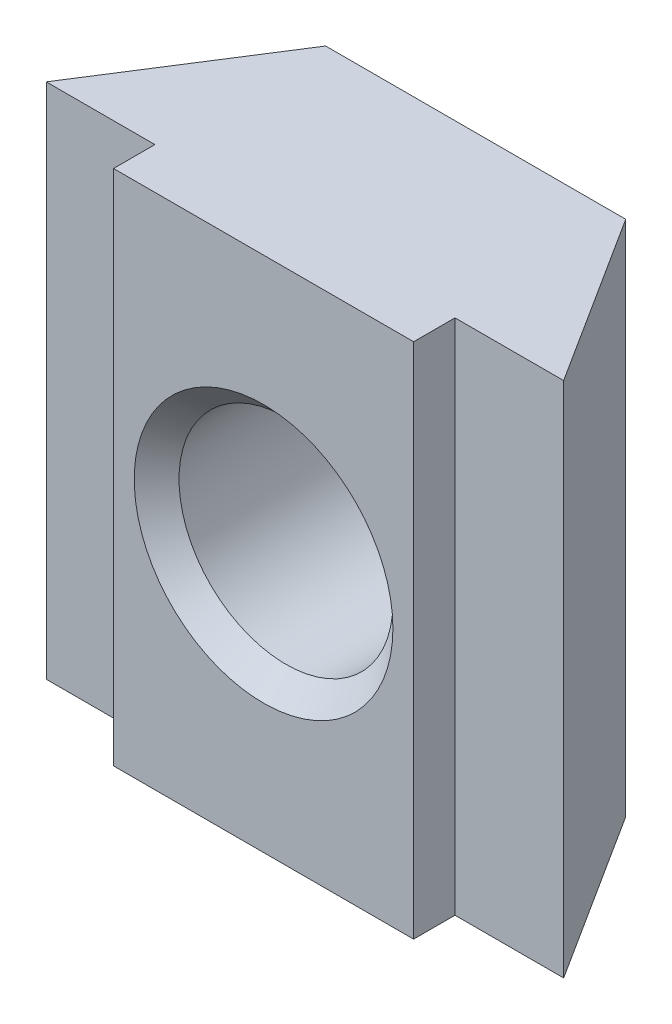
ISO-10303-21;
HEADER;
FILE_DESCRIPTION(('STEP AP214'),'2;1');
FILE_NAME('part.step','',(''),(''),'','','');
FILE_SCHEMA(('AUTOMOTIVE_DESIGN { 1 0 10303 214 1 1 1 1 }'));
ENDSEC;
DATA;
#1=APPLICATION_CONTEXT('core data for automotive mechanical design processes');
#2=APPLICATION_PROTOCOL_DEFINITION('international standard','automotive_design',2000,#1);
#3=PRODUCT_CONTEXT('',#1,'mechanical');
#4=PRODUCT('Part','Part','',(#3));
#5=PRODUCT_RELATED_PRODUCT_CATEGORY('part','',(#4));
#6=PRODUCT_DEFINITION_FORMATION('','',#4);
#7=PRODUCT_DEFINITION_CONTEXT('part definition',#1,'design');
#8=PRODUCT_DEFINITION('design','',#6,#7);
#9=PRODUCT_DEFINITION_SHAPE('','',#8);
#10=(LENGTH_UNIT() NAMED_UNIT(*) SI_UNIT(.MILLI.,.METRE.));
#11=(NAMED_UNIT(*) PLANE_ANGLE_UNIT() SI_UNIT($,.RADIAN.));
#12=(NAMED_UNIT(*) SI_UNIT($,.STERADIAN.) SOLID_ANGLE_UNIT());
#13=UNCERTAINTY_MEASURE_WITH_UNIT(LENGTH_MEASURE(1.E-05),#10,'distance_accuracy_value','');
#14=(GEOMETRIC_REPRESENTATION_CONTEXT(3) GLOBAL_UNCERTAINTY_ASSIGNED_CONTEXT((#13)) GLOBAL_UNIT_ASSIGNED_CONTEXT((#10,
#11,#12)) REPRESENTATION_CONTEXT('',''));
#15=CARTESIAN_POINT('',(0.,0.,0.));
#16=DIRECTION('',(0.,0.,1.));
#17=DIRECTION('',(1.,0.,0.));
#18=AXIS2_PLACEMENT_3D('',#15,#16,#17);
#19=CARTESIAN_POINT('',(-13.,21.5,-9.30000000010978));
#20=DIRECTION('',(0.,0.,1.));
#21=DIRECTION('',(1.,0.,0.));
#22=AXIS2_PLACEMENT_3D('',#19,#20,#21);
#23=CONICAL_SURFACE('',#22,2.49999999991769,0.785398163397448);
#24=CARTESIAN_POINT('',(-13.,21.5,-9.30000000005293));
#25=DIRECTION('',(0.,0.,1.));
#26=DIRECTION('',(1.,0.,0.));
#27=AXIS2_PLACEMENT_3D('',#24,#25,#26);
#28=CIRCLE('',#27,2.49999999997453);
#29=CARTESIAN_POINT('',(-10.5000000000255,21.5,-9.30000000005293));
#30=VERTEX_POINT('',#29);
#31=EDGE_CURVE('E20',#30,#30,#28,.F.);
#32=ORIENTED_EDGE('',*,*,#31,.F.);
#33=EDGE_LOOP('',(#32));
#34=FACE_BOUND('',#33,.T.);
#35=CARTESIAN_POINT('',(-13.,21.5,-9.733));
#36=DIRECTION('',(0.,0.,1.));
#37=DIRECTION('',(1.,0.,0.));
#38=AXIS2_PLACEMENT_3D('',#35,#36,#37);
#39=CIRCLE('',#38,2.067);
#40=CARTESIAN_POINT('',(-10.933,21.5,-9.733));
#41=VERTEX_POINT('',#40);
#42=EDGE_CURVE('E122',#41,#41,#39,.F.);
#43=ORIENTED_EDGE('',*,*,#42,.T.);
#44=EDGE_LOOP('',(#43));
#45=FACE_BOUND('',#44,.T.);
#46=ADVANCED_FACE('F17',(#34,#45),#23,.F.);
#47=CARTESIAN_POINT('',(-15.9,16.5,-9.3));
#48=DIRECTION('',(-1.,0.,0.));
#49=DIRECTION('',(0.,0.,1.));
#50=AXIS2_PLACEMENT_3D('',#47,#48,#49);
#51=PLANE('',#50);
#52=DIRECTION('',(0.,0.,1.));
#53=VECTOR('',#52,1.);
#54=CARTESIAN_POINT('',(-15.9,16.5,-9.3));
#55=LINE('',#54,#53);
#56=CARTESIAN_POINT('',(-15.9,16.5,-10.1));
#57=VERTEX_POINT('',#56);
#58=CARTESIAN_POINT('',(-15.9,16.5,-9.3));
#59=VERTEX_POINT('',#58);
#60=EDGE_CURVE('E125',#57,#59,#55,.T.);
#61=ORIENTED_EDGE('',*,*,#60,.T.);
#62=DIRECTION('',(0.,1.,0.));
#63=VECTOR('',#62,1.);
#64=CARTESIAN_POINT('',(-15.9,16.5,-9.3));
#65=LINE('',#64,#63);
#66=CARTESIAN_POINT('',(-15.9,26.5,-9.3));
#67=VERTEX_POINT('',#66);
#68=EDGE_CURVE('E104',#67,#59,#65,.F.);
#69=ORIENTED_EDGE('',*,*,#68,.F.);
#70=DIRECTION('',(0.,0.,1.));
#71=VECTOR('',#70,1.);
#72=CARTESIAN_POINT('',(-15.9,26.5,-9.3));
#73=LINE('',#72,#71);
#74=CARTESIAN_POINT('',(-15.9,26.5,-10.1));
#75=VERTEX_POINT('',#74);
#76=EDGE_CURVE('E79',#67,#75,#73,.F.);
#77=ORIENTED_EDGE('',*,*,#76,.T.);
#78=DIRECTION('',(0.,1.,0.));
#79=VECTOR('',#78,1.);
#80=CARTESIAN_POINT('',(-15.9,16.5,-10.1));
#81=LINE('',#80,#79);
#82=EDGE_CURVE('E103',#57,#75,#81,.T.);
#83=ORIENTED_EDGE('',*,*,#82,.F.);
#84=EDGE_LOOP('',(#61,#69,#77,#83));
#85=FACE_BOUND('',#84,.T.);
#86=ADVANCED_FACE('F263',(#85),#51,.T.);
#87=CARTESIAN_POINT('',(-13.,21.5,-11.35));
#88=DIRECTION('',(0.,0.,1.));
#89=DIRECTION('',(1.,0.,0.));
#90=AXIS2_PLACEMENT_3D('',#87,#88,#89);
#91=CYLINDRICAL_SURFACE('',#90,2.067);
#92=CARTESIAN_POINT('',(-13.,21.5,-12.9670000000033));
#93=DIRECTION('',(0.,0.,-1.));
#94=DIRECTION('',(-1.,0.,0.));
#95=AXIS2_PLACEMENT_3D('',#92,#93,#94);
#96=CIRCLE('',#95,2.06699999998773);
#97=CARTESIAN_POINT('',(-15.0669999999877,21.5,-12.9670000000033));
#98=VERTEX_POINT('',#97);
#99=EDGE_CURVE('E116',#98,#98,#96,.T.);
#100=ORIENTED_EDGE('',*,*,#99,.T.);
#101=EDGE_LOOP('',(#100));
#102=FACE_BOUND('',#101,.T.);
#103=ORIENTED_EDGE('',*,*,#42,.F.);
#104=EDGE_LOOP('',(#103));
#105=FACE_BOUND('',#104,.T.);
#106=ADVANCED_FACE('F254',(#102,#105),#91,.F.);
#107=CARTESIAN_POINT('',(-10.1,16.5,-10.1));
#108=DIRECTION('',(1.,0.,0.));
#109=DIRECTION('',(0.,0.,-1.));
#110=AXIS2_PLACEMENT_3D('',#107,#108,#109);
#111=PLANE('',#110);
#112=DIRECTION('',(0.,0.,-1.));
#113=VECTOR('',#112,1.);
#114=CARTESIAN_POINT('',(-10.1,16.5,-10.1));
#115=LINE('',#114,#113);
#116=CARTESIAN_POINT('',(-10.1,16.5,-9.3));
#117=VERTEX_POINT('',#116);
#118=CARTESIAN_POINT('',(-10.1,16.5,-10.1));
#119=VERTEX_POINT('',#118);
#120=EDGE_CURVE('E120',#117,#119,#115,.T.);
#121=ORIENTED_EDGE('',*,*,#120,.T.);
#122=DIRECTION('',(0.,1.,0.));
#123=VECTOR('',#122,1.);
#124=CARTESIAN_POINT('',(-10.1,16.5,-10.1));
#125=LINE('',#124,#123);
#126=CARTESIAN_POINT('',(-10.1,26.5,-10.1));
#127=VERTEX_POINT('',#126);
#128=EDGE_CURVE('E91',#127,#119,#125,.F.);
#129=ORIENTED_EDGE('',*,*,#128,.F.);
#130=DIRECTION('',(0.,0.,-1.));
#131=VECTOR('',#130,1.);
#132=CARTESIAN_POINT('',(-10.1,26.5,-9.3));
#133=LINE('',#132,#131);
#134=CARTESIAN_POINT('',(-10.1,26.5,-9.3));
#135=VERTEX_POINT('',#134);
#136=EDGE_CURVE('E85',#127,#135,#133,.F.);
#137=ORIENTED_EDGE('',*,*,#136,.T.);
#138=DIRECTION('',(0.,1.,0.));
#139=VECTOR('',#138,1.);
#140=CARTESIAN_POINT('',(-10.1,16.5,-9.3));
#141=LINE('',#140,#139);
#142=EDGE_CURVE('E88',#117,#135,#141,.T.);
#143=ORIENTED_EDGE('',*,*,#142,.F.);
#144=EDGE_LOOP('',(#121,#129,#137,#143));
#145=FACE_BOUND('',#144,.T.);
#146=ADVANCED_FACE('F87',(#145),#111,.T.);
#147=CARTESIAN_POINT('',(-10.1,16.5,-9.3));
#148=DIRECTION('',(0.,0.,1.));
#149=DIRECTION('',(1.,0.,0.));
#150=AXIS2_PLACEMENT_3D('',#147,#148,#149);
#151=PLANE('',#150);
#152=DIRECTION('',(1.,0.,0.));
#153=VECTOR('',#152,1.);
#154=CARTESIAN_POINT('',(-13.,16.5,-9.3));
#155=LINE('',#154,#153);
#156=EDGE_CURVE('E102',#117,#59,#155,.F.);
#157=ORIENTED_EDGE('',*,*,#156,.F.);
#158=ORIENTED_EDGE('',*,*,#142,.T.);
#159=DIRECTION('',(1.,0.,0.));
#160=VECTOR('',#159,1.);
#161=CARTESIAN_POINT('',(-13.,26.5,-9.3));
#162=LINE('',#161,#160);
#163=EDGE_CURVE('E93',#135,#67,#162,.F.);
#164=ORIENTED_EDGE('',*,*,#163,.T.);
#165=ORIENTED_EDGE('',*,*,#68,.T.);
#166=EDGE_LOOP('',(#157,#158,#164,#165));
#167=FACE_BOUND('',#166,.T.);
#168=ORIENTED_EDGE('',*,*,#31,.T.);
#169=EDGE_LOOP('',(#168));
#170=FACE_BOUND('',#169,.T.);
#171=ADVANCED_FACE('F98',(#167,#170),#151,.T.);
#172=CARTESIAN_POINT('',(-15.9,16.5,-10.1));
#173=DIRECTION('',(0.,0.,1.));
#174=DIRECTION('',(1.,0.,0.));
#175=AXIS2_PLACEMENT_3D('',#172,#173,#174);
#176=PLANE('',#175);
#177=DIRECTION('',(1.,0.,0.));
#178=VECTOR('',#177,1.);
#179=CARTESIAN_POINT('',(-13.,16.5,-10.1));
#180=LINE('',#179,#178);
#181=CARTESIAN_POINT('',(-18.,16.5,-10.1));
#182=VERTEX_POINT('',#181);
#183=EDGE_CURVE('E137',#57,#182,#180,.F.);
#184=ORIENTED_EDGE('',*,*,#183,.F.);
#185=ORIENTED_EDGE('',*,*,#82,.T.);
#186=DIRECTION('',(1.,0.,0.));
#187=VECTOR('',#186,1.);
#188=CARTESIAN_POINT('',(-13.,26.5,-10.1));
#189=LINE('',#188,#187);
#190=CARTESIAN_POINT('',(-18.,26.5,-10.1));
#191=VERTEX_POINT('',#190);
#192=EDGE_CURVE('E108',#75,#191,#189,.F.);
#193=ORIENTED_EDGE('',*,*,#192,.T.);
#194=DIRECTION('',(0.,1.,0.));
#195=VECTOR('',#194,1.);
#196=CARTESIAN_POINT('',(-18.,16.5,-10.1));
#197=LINE('',#196,#195);
#198=EDGE_CURVE('E94',#182,#191,#197,.T.);
#199=ORIENTED_EDGE('',*,*,#198,.F.);
#200=EDGE_LOOP('',(#184,#185,#193,#199));
#201=FACE_BOUND('',#200,.T.);
#202=ADVANCED_FACE('F227',(#201),#176,.T.);
#203=CARTESIAN_POINT('',(-13.,21.5,-13.3999999999332));
#204=DIRECTION('',(0.,0.,-1.));
#205=DIRECTION('',(-1.,0.,0.));
#206=AXIS2_PLACEMENT_3D('',#203,#204,#205);
#207=CONICAL_SURFACE('',#206,2.49999999991769,0.785398163397448);
#208=CARTESIAN_POINT('',(-13.,21.5,-13.3999999999901));
#209=DIRECTION('',(0.,0.,-1.));
#210=DIRECTION('',(-1.,0.,0.));
#211=AXIS2_PLACEMENT_3D('',#208,#209,#210);
#212=CIRCLE('',#211,2.49999999997453);
#213=CARTESIAN_POINT('',(-15.4999999999745,21.5,-13.3999999999901));
#214=VERTEX_POINT('',#213);
#215=EDGE_CURVE('E129',#214,#214,#212,.F.);
#216=ORIENTED_EDGE('',*,*,#215,.F.);
#217=EDGE_LOOP('',(#216));
#218=FACE_BOUND('',#217,.T.);
#219=ORIENTED_EDGE('',*,*,#99,.F.);
#220=EDGE_LOOP('',(#219));
#221=FACE_BOUND('',#220,.T.);
#222=ADVANCED_FACE('F218',(#218,#221),#207,.F.);
#223=CARTESIAN_POINT('',(-18.,16.5,-10.1));
#224=DIRECTION('',(-0.843661487732107,0.,-0.536875492193159));
#225=DIRECTION('',(-0.536875492193159,0.,0.843661487732107));
#226=AXIS2_PLACEMENT_3D('',#223,#224,#225);
#227=PLANE('',#226);
#228=DIRECTION('',(0.536875492193159,0.,-0.843661487732107));
#229=VECTOR('',#228,1.);
#230=CARTESIAN_POINT('',(-18.,16.5,-10.1));
#231=LINE('',#230,#229);
#232=CARTESIAN_POINT('',(-15.9,16.5,-13.4));
#233=VERTEX_POINT('',#232);
#234=EDGE_CURVE('E132',#182,#233,#231,.T.);
#235=ORIENTED_EDGE('',*,*,#234,.F.);
#236=ORIENTED_EDGE('',*,*,#198,.T.);
#237=DIRECTION('',(0.536875492193159,0.,-0.843661487732107));
#238=VECTOR('',#237,1.);
#239=CARTESIAN_POINT('',(-18.,26.5,-10.1));
#240=LINE('',#239,#238);
#241=CARTESIAN_POINT('',(-15.9,26.5,-13.4));
#242=VERTEX_POINT('',#241);
#243=EDGE_CURVE('E110',#191,#242,#240,.T.);
#244=ORIENTED_EDGE('',*,*,#243,.T.);
#245=DIRECTION('',(0.,1.,0.));
#246=VECTOR('',#245,1.);
#247=CARTESIAN_POINT('',(-15.9,16.5,-13.4));
#248=LINE('',#247,#246);
#249=EDGE_CURVE('E155',#233,#242,#248,.T.);
#250=ORIENTED_EDGE('',*,*,#249,.F.);
#251=EDGE_LOOP('',(#235,#236,#244,#250));
#252=FACE_BOUND('',#251,.T.);
#253=ADVANCED_FACE('F153',(#252),#227,.T.);
#254=CARTESIAN_POINT('',(-13.,26.5,-9.3));
#255=DIRECTION('',(0.,-1.,0.));
#256=DIRECTION('',(0.,0.,-1.));
#257=AXIS2_PLACEMENT_3D('',#254,#255,#256);
#258=PLANE('',#257);
#259=DIRECTION('',(-1.,0.,0.));
#260=VECTOR('',#259,1.);
#261=CARTESIAN_POINT('',(-15.9,26.5,-13.4));
#262=LINE('',#261,#260);
#263=CARTESIAN_POINT('',(-10.1,26.5,-13.4));
#264=VERTEX_POINT('',#263);
#265=EDGE_CURVE('E131',#242,#264,#262,.F.);
#266=ORIENTED_EDGE('',*,*,#265,.F.);
#267=ORIENTED_EDGE('',*,*,#243,.F.);
#268=ORIENTED_EDGE('',*,*,#192,.F.);
#269=ORIENTED_EDGE('',*,*,#76,.F.);
#270=ORIENTED_EDGE('',*,*,#163,.F.);
#271=ORIENTED_EDGE('',*,*,#136,.F.);
#272=DIRECTION('',(1.,0.,0.));
#273=VECTOR('',#272,1.);
#274=CARTESIAN_POINT('',(-8.,26.5,-10.1));
#275=LINE('',#274,#273);
#276=CARTESIAN_POINT('',(-8.,26.5,-10.1));
#277=VERTEX_POINT('',#276);
#278=EDGE_CURVE('E150',#277,#127,#275,.F.);
#279=ORIENTED_EDGE('',*,*,#278,.F.);
#280=DIRECTION('',(-0.536875492193159,0.,-0.843661487732107));
#281=VECTOR('',#280,1.);
#282=CARTESIAN_POINT('',(-10.1,26.5,-13.4));
#283=LINE('',#282,#281);
#284=EDGE_CURVE('E157',#264,#277,#283,.F.);
#285=ORIENTED_EDGE('',*,*,#284,.F.);
#286=EDGE_LOOP('',(#266,#267,#268,#269,#270,#271,#279,#285));
#287=FACE_BOUND('',#286,.T.);
#288=ADVANCED_FACE('F107',(#287),#258,.F.);
#289=CARTESIAN_POINT('',(-8.,16.5,-10.1));
#290=DIRECTION('',(0.,0.,1.));
#291=DIRECTION('',(1.,0.,0.));
#292=AXIS2_PLACEMENT_3D('',#289,#290,#291);
#293=PLANE('',#292);
#294=DIRECTION('',(1.,0.,0.));
#295=VECTOR('',#294,1.);
#296=CARTESIAN_POINT('',(-13.,16.5,-10.1));
#297=LINE('',#296,#295);
#298=CARTESIAN_POINT('',(-8.,16.5,-10.1));
#299=VERTEX_POINT('',#298);
#300=EDGE_CURVE('E146',#299,#119,#297,.F.);
#301=ORIENTED_EDGE('',*,*,#300,.F.);
#302=DIRECTION('',(0.,1.,0.));
#303=VECTOR('',#302,1.);
#304=CARTESIAN_POINT('',(-8.,16.5,-10.1));
#305=LINE('',#304,#303);
#306=EDGE_CURVE('E161',#277,#299,#305,.F.);
#307=ORIENTED_EDGE('',*,*,#306,.F.);
#308=ORIENTED_EDGE('',*,*,#278,.T.);
#309=ORIENTED_EDGE('',*,*,#128,.T.);
#310=EDGE_LOOP('',(#301,#307,#308,#309));
#311=FACE_BOUND('',#310,.T.);
#312=ADVANCED_FACE('F172',(#311),#293,.T.);
#313=CARTESIAN_POINT('',(-13.,16.5,-9.3));
#314=DIRECTION('',(0.,-1.,0.));
#315=DIRECTION('',(0.,0.,-1.));
#316=AXIS2_PLACEMENT_3D('',#313,#314,#315);
#317=PLANE('',#316);
#318=ORIENTED_EDGE('',*,*,#183,.T.);
#319=ORIENTED_EDGE('',*,*,#234,.T.);
#320=DIRECTION('',(-1.,0.,0.));
#321=VECTOR('',#320,1.);
#322=CARTESIAN_POINT('',(-15.9,16.5,-13.4));
#323=LINE('',#322,#321);
#324=CARTESIAN_POINT('',(-10.1,16.5,-13.4));
#325=VERTEX_POINT('',#324);
#326=EDGE_CURVE('E35',#325,#233,#323,.T.);
#327=ORIENTED_EDGE('',*,*,#326,.F.);
#328=DIRECTION('',(-0.536875492193159,0.,-0.843661487732107));
#329=VECTOR('',#328,1.);
#330=CARTESIAN_POINT('',(-10.1,16.5,-13.4));
#331=LINE('',#330,#329);
#332=EDGE_CURVE('E26',#299,#325,#331,.T.);
#333=ORIENTED_EDGE('',*,*,#332,.F.);
#334=ORIENTED_EDGE('',*,*,#300,.T.);
#335=ORIENTED_EDGE('',*,*,#120,.F.);
#336=ORIENTED_EDGE('',*,*,#156,.T.);
#337=ORIENTED_EDGE('',*,*,#60,.F.);
#338=EDGE_LOOP('',(#318,#319,#327,#333,#334,#335,#336,#337));
#339=FACE_BOUND('',#338,.T.);
#340=ADVANCED_FACE('F170',(#339),#317,.T.);
#341=CARTESIAN_POINT('',(-15.9,16.5,-13.4));
#342=DIRECTION('',(0.,0.,-1.));
#343=DIRECTION('',(-1.,0.,0.));
#344=AXIS2_PLACEMENT_3D('',#341,#342,#343);
#345=PLANE('',#344);
#346=ORIENTED_EDGE('',*,*,#326,.T.);
#347=ORIENTED_EDGE('',*,*,#249,.T.);
#348=ORIENTED_EDGE('',*,*,#265,.T.);
#349=DIRECTION('',(0.,1.,0.));
#350=VECTOR('',#349,1.);
#351=CARTESIAN_POINT('',(-10.1,16.5,-13.4));
#352=LINE('',#351,#350);
#353=EDGE_CURVE('E11',#325,#264,#352,.T.);
#354=ORIENTED_EDGE('',*,*,#353,.F.);
#355=EDGE_LOOP('',(#346,#347,#348,#354));
#356=FACE_BOUND('',#355,.T.);
#357=ORIENTED_EDGE('',*,*,#215,.T.);
#358=EDGE_LOOP('',(#357));
#359=FACE_BOUND('',#358,.T.);
#360=ADVANCED_FACE('F159',(#356,#359),#345,.T.);
#361=CARTESIAN_POINT('',(-10.1,16.5,-13.4));
#362=DIRECTION('',(0.843661487732107,0.,-0.536875492193159));
#363=DIRECTION('',(-0.536875492193159,0.,-0.843661487732107));
#364=AXIS2_PLACEMENT_3D('',#361,#362,#363);
#365=PLANE('',#364);
#366=ORIENTED_EDGE('',*,*,#332,.T.);
#367=ORIENTED_EDGE('',*,*,#353,.T.);
#368=ORIENTED_EDGE('',*,*,#284,.T.);
#369=ORIENTED_EDGE('',*,*,#306,.T.);
#370=EDGE_LOOP('',(#366,#367,#368,#369));
#371=FACE_BOUND('',#370,.T.);
#372=ADVANCED_FACE('F168',(#371),#365,.T.);
#373=CLOSED_SHELL('',(#46,#86,#106,#146,#171,#202,#222,#253,#288,#312,#340,#360,#372));
#374=MANIFOLD_SOLID_BREP('B1',#373);
#375=ADVANCED_BREP_SHAPE_REPRESENTATION('',(#18,#374),#14);
#376=SHAPE_DEFINITION_REPRESENTATION(#9,#375);
ENDSEC;
END-ISO-10303-21;
